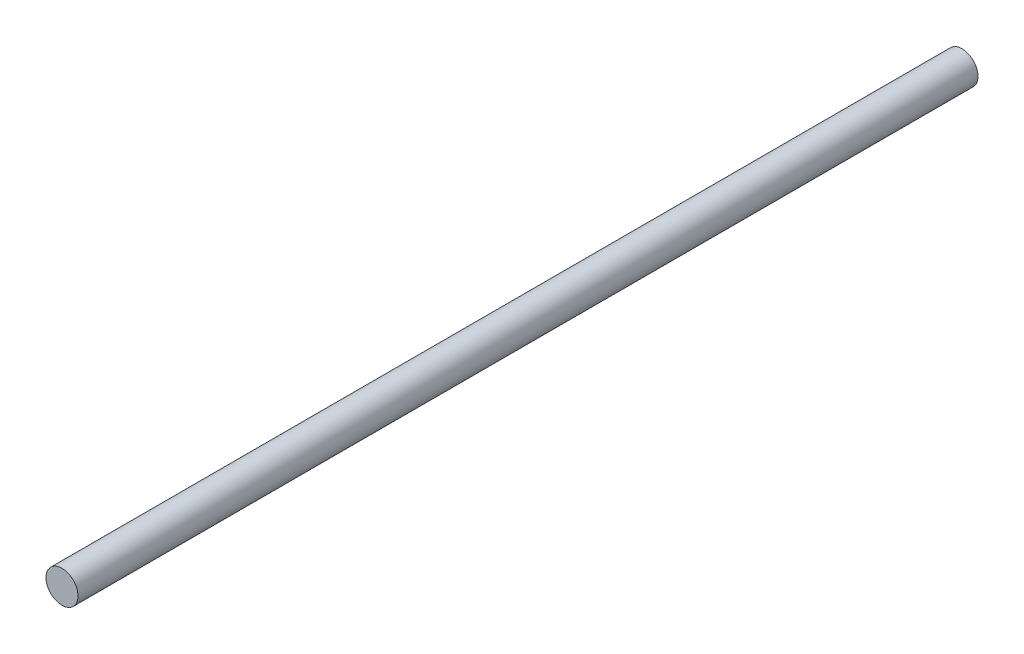
ISO-10303-21;
HEADER;
FILE_DESCRIPTION(('STEP AP214'),'2;1');
FILE_NAME('part.step','',(''),(''),'','','');
FILE_SCHEMA(('AUTOMOTIVE_DESIGN { 1 0 10303 214 1 1 1 1 }'));
ENDSEC;
DATA;
#1=APPLICATION_CONTEXT('core data for automotive mechanical design processes');
#2=APPLICATION_PROTOCOL_DEFINITION('international standard','automotive_design',2000,#1);
#3=PRODUCT_CONTEXT('',#1,'mechanical');
#4=PRODUCT('Part','Part','',(#3));
#5=PRODUCT_RELATED_PRODUCT_CATEGORY('part','',(#4));
#6=PRODUCT_DEFINITION_FORMATION('','',#4);
#7=PRODUCT_DEFINITION_CONTEXT('part definition',#1,'design');
#8=PRODUCT_DEFINITION('design','',#6,#7);
#9=PRODUCT_DEFINITION_SHAPE('','',#8);
#10=(LENGTH_UNIT() NAMED_UNIT(*) SI_UNIT(.MILLI.,.METRE.));
#11=(NAMED_UNIT(*) PLANE_ANGLE_UNIT() SI_UNIT($,.RADIAN.));
#12=(NAMED_UNIT(*) SI_UNIT($,.STERADIAN.) SOLID_ANGLE_UNIT());
#13=UNCERTAINTY_MEASURE_WITH_UNIT(LENGTH_MEASURE(1.E-05),#10,'distance_accuracy_value','');
#14=(GEOMETRIC_REPRESENTATION_CONTEXT(3) GLOBAL_UNCERTAINTY_ASSIGNED_CONTEXT((#13)) GLOBAL_UNIT_ASSIGNED_CONTEXT((#10,
#11,#12)) REPRESENTATION_CONTEXT('',''));
#15=CARTESIAN_POINT('',(0.,0.,0.));
#16=DIRECTION('',(0.,0.,1.));
#17=DIRECTION('',(1.,0.,0.));
#18=AXIS2_PLACEMENT_3D('',#15,#16,#17);
#19=CARTESIAN_POINT('',(0.,0.,250.));
#20=DIRECTION('',(0.,0.,-1.));
#21=DIRECTION('',(-1.,0.,0.));
#22=AXIS2_PLACEMENT_3D('',#19,#20,#21);
#23=CYLINDRICAL_SURFACE('',#22,4.45);
#24=CARTESIAN_POINT('',(0.,0.,250.));
#25=DIRECTION('',(0.,0.,1.));
#26=DIRECTION('',(1.,0.,0.));
#27=AXIS2_PLACEMENT_3D('',#24,#25,#26);
#28=CIRCLE('',#27,4.45);
#29=CARTESIAN_POINT('',(4.45,0.,250.));
#30=VERTEX_POINT('',#29);
#31=EDGE_CURVE('E10',#30,#30,#28,.T.);
#32=ORIENTED_EDGE('',*,*,#31,.F.);
#33=EDGE_LOOP('',(#32));
#34=FACE_BOUND('',#33,.T.);
#35=CARTESIAN_POINT('',(0.,0.,0.));
#36=DIRECTION('',(0.,0.,1.));
#37=DIRECTION('',(1.,0.,0.));
#38=AXIS2_PLACEMENT_3D('',#35,#36,#37);
#39=CIRCLE('',#38,4.45);
#40=CARTESIAN_POINT('',(4.45,0.,0.));
#41=VERTEX_POINT('',#40);
#42=EDGE_CURVE('E35',#41,#41,#39,.T.);
#43=ORIENTED_EDGE('',*,*,#42,.T.);
#44=EDGE_LOOP('',(#43));
#45=FACE_BOUND('',#44,.T.);
#46=ADVANCED_FACE('F32',(#34,#45),#23,.T.);
#47=CARTESIAN_POINT('',(0.,0.,250.));
#48=DIRECTION('',(0.,0.,1.));
#49=DIRECTION('',(1.,0.,0.));
#50=AXIS2_PLACEMENT_3D('',#47,#48,#49);
#51=PLANE('',#50);
#52=ORIENTED_EDGE('',*,*,#31,.T.);
#53=EDGE_LOOP('',(#52));
#54=FACE_BOUND('',#53,.T.);
#55=ADVANCED_FACE('F47',(#54),#51,.T.);
#56=CARTESIAN_POINT('',(0.,0.,0.));
#57=DIRECTION('',(0.,0.,1.));
#58=DIRECTION('',(1.,0.,0.));
#59=AXIS2_PLACEMENT_3D('',#56,#57,#58);
#60=PLANE('',#59);
#61=ORIENTED_EDGE('',*,*,#42,.F.);
#62=EDGE_LOOP('',(#61));
#63=FACE_BOUND('',#62,.T.);
#64=ADVANCED_FACE('F45',(#63),#60,.F.);
#65=CLOSED_SHELL('',(#46,#55,#64));
#66=MANIFOLD_SOLID_BREP('B2',#65);
#67=ADVANCED_BREP_SHAPE_REPRESENTATION('',(#18,#66),#14);
#68=SHAPE_DEFINITION_REPRESENTATION(#9,#67);
ENDSEC;
END-ISO-10303-21;
